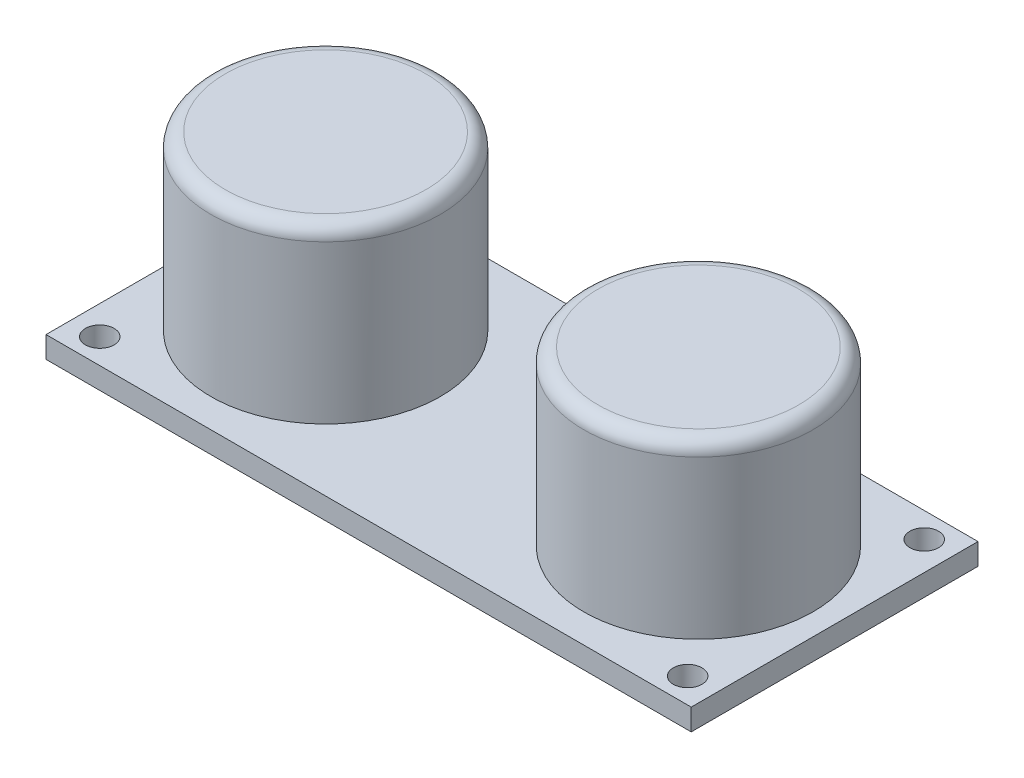
ISO-10303-21;
HEADER;
FILE_DESCRIPTION(('STEP AP214'),'2;1');
FILE_NAME('part.step','',(''),(''),'','','');
FILE_SCHEMA(('AUTOMOTIVE_DESIGN { 1 0 10303 214 1 1 1 1 }'));
ENDSEC;
DATA;
#1=APPLICATION_CONTEXT('core data for automotive mechanical design processes');
#2=APPLICATION_PROTOCOL_DEFINITION('international standard','automotive_design',2000,#1);
#3=PRODUCT_CONTEXT('',#1,'mechanical');
#4=PRODUCT('Part','Part','',(#3));
#5=PRODUCT_RELATED_PRODUCT_CATEGORY('part','',(#4));
#6=PRODUCT_DEFINITION_FORMATION('','',#4);
#7=PRODUCT_DEFINITION_CONTEXT('part definition',#1,'design');
#8=PRODUCT_DEFINITION('design','',#6,#7);
#9=PRODUCT_DEFINITION_SHAPE('','',#8);
#10=(LENGTH_UNIT() NAMED_UNIT(*) SI_UNIT(.MILLI.,.METRE.));
#11=(NAMED_UNIT(*) PLANE_ANGLE_UNIT() SI_UNIT($,.RADIAN.));
#12=(NAMED_UNIT(*) SI_UNIT($,.STERADIAN.) SOLID_ANGLE_UNIT());
#13=UNCERTAINTY_MEASURE_WITH_UNIT(LENGTH_MEASURE(1.E-05),#10,'distance_accuracy_value','');
#14=(GEOMETRIC_REPRESENTATION_CONTEXT(3) GLOBAL_UNCERTAINTY_ASSIGNED_CONTEXT((#13)) GLOBAL_UNIT_ASSIGNED_CONTEXT((#10,
#11,#12)) REPRESENTATION_CONTEXT('',''));
#15=CARTESIAN_POINT('',(0.,0.,0.));
#16=DIRECTION('',(0.,0.,1.));
#17=DIRECTION('',(1.,0.,0.));
#18=AXIS2_PLACEMENT_3D('',#15,#16,#17);
#19=CARTESIAN_POINT('',(0.,1.5,0.));
#20=DIRECTION('',(0.,-1.,0.));
#21=DIRECTION('',(0.,0.,-1.));
#22=AXIS2_PLACEMENT_3D('',#19,#20,#21);
#23=PLANE('',#22);
#24=CARTESIAN_POINT('',(35.5,1.5,-9.99999999999998));
#25=DIRECTION('',(0.,-1.,0.));
#26=DIRECTION('',(0.,0.,-1.));
#27=AXIS2_PLACEMENT_3D('',#24,#25,#26);
#28=CIRCLE('',#27,8.);
#29=CARTESIAN_POINT('',(35.5,1.5,-18.));
#30=VERTEX_POINT('',#29);
#31=EDGE_CURVE('E116',#30,#30,#28,.F.);
#32=ORIENTED_EDGE('',*,*,#31,.F.);
#33=EDGE_LOOP('',(#32));
#34=FACE_BOUND('',#33,.T.);
#35=CARTESIAN_POINT('',(9.5,1.5,-10.));
#36=DIRECTION('',(0.,-1.,0.));
#37=DIRECTION('',(0.,0.,-1.));
#38=AXIS2_PLACEMENT_3D('',#35,#36,#37);
#39=CIRCLE('',#38,8.);
#40=CARTESIAN_POINT('',(9.5,1.5,-18.));
#41=VERTEX_POINT('',#40);
#42=EDGE_CURVE('E113',#41,#41,#39,.F.);
#43=ORIENTED_EDGE('',*,*,#42,.F.);
#44=EDGE_LOOP('',(#43));
#45=FACE_BOUND('',#44,.T.);
#46=DIRECTION('',(0.,0.,1.));
#47=VECTOR('',#46,1.);
#48=CARTESIAN_POINT('',(0.,1.5,0.));
#49=LINE('',#48,#47);
#50=CARTESIAN_POINT('',(0.,1.5,-20.));
#51=VERTEX_POINT('',#50);
#52=CARTESIAN_POINT('',(0.,1.5,0.));
#53=VERTEX_POINT('',#52);
#54=EDGE_CURVE('E88',#51,#53,#49,.T.);
#55=ORIENTED_EDGE('',*,*,#54,.T.);
#56=DIRECTION('',(1.,0.,0.));
#57=VECTOR('',#56,1.);
#58=CARTESIAN_POINT('',(0.,1.5,0.));
#59=LINE('',#58,#57);
#60=CARTESIAN_POINT('',(45.,1.5,0.));
#61=VERTEX_POINT('',#60);
#62=EDGE_CURVE('E83',#53,#61,#59,.T.);
#63=ORIENTED_EDGE('',*,*,#62,.T.);
#64=DIRECTION('',(0.,0.,-1.));
#65=VECTOR('',#64,1.);
#66=CARTESIAN_POINT('',(45.,1.5,0.));
#67=LINE('',#66,#65);
#68=CARTESIAN_POINT('',(45.,1.5,-20.));
#69=VERTEX_POINT('',#68);
#70=EDGE_CURVE('E86',#61,#69,#67,.T.);
#71=ORIENTED_EDGE('',*,*,#70,.T.);
#72=DIRECTION('',(-1.,0.,0.));
#73=VECTOR('',#72,1.);
#74=CARTESIAN_POINT('',(0.,1.5,-20.));
#75=LINE('',#74,#73);
#76=EDGE_CURVE('E52',#69,#51,#75,.T.);
#77=ORIENTED_EDGE('',*,*,#76,.T.);
#78=EDGE_LOOP('',(#55,#63,#71,#77));
#79=FACE_BOUND('',#78,.T.);
#80=CARTESIAN_POINT('',(2.,1.5,-18.25));
#81=DIRECTION('',(0.,1.,0.));
#82=DIRECTION('',(0.,0.,1.));
#83=AXIS2_PLACEMENT_3D('',#80,#81,#82);
#84=CIRCLE('',#83,1.);
#85=CARTESIAN_POINT('',(2.,1.5,-17.25));
#86=VERTEX_POINT('',#85);
#87=EDGE_CURVE('E106',#86,#86,#84,.T.);
#88=ORIENTED_EDGE('',*,*,#87,.F.);
#89=EDGE_LOOP('',(#88));
#90=FACE_BOUND('',#89,.T.);
#91=CARTESIAN_POINT('',(2.,1.5,-1.75));
#92=DIRECTION('',(0.,1.,0.));
#93=DIRECTION('',(0.,0.,1.));
#94=AXIS2_PLACEMENT_3D('',#91,#92,#93);
#95=CIRCLE('',#94,1.);
#96=CARTESIAN_POINT('',(2.,1.5,-0.749999999999998));
#97=VERTEX_POINT('',#96);
#98=EDGE_CURVE('E186',#97,#97,#95,.T.);
#99=ORIENTED_EDGE('',*,*,#98,.F.);
#100=EDGE_LOOP('',(#99));
#101=FACE_BOUND('',#100,.T.);
#102=CARTESIAN_POINT('',(43.,1.5,-1.75));
#103=DIRECTION('',(0.,1.,0.));
#104=DIRECTION('',(0.,0.,-1.));
#105=AXIS2_PLACEMENT_3D('',#102,#103,#104);
#106=CIRCLE('',#105,1.00000000000001);
#107=CARTESIAN_POINT('',(43.,1.5,-2.75000000000001));
#108=VERTEX_POINT('',#107);
#109=EDGE_CURVE('E181',#108,#108,#106,.T.);
#110=ORIENTED_EDGE('',*,*,#109,.F.);
#111=EDGE_LOOP('',(#110));
#112=FACE_BOUND('',#111,.T.);
#113=CARTESIAN_POINT('',(43.,1.5,-18.25));
#114=DIRECTION('',(0.,1.,0.));
#115=DIRECTION('',(0.,0.,-1.));
#116=AXIS2_PLACEMENT_3D('',#113,#114,#115);
#117=CIRCLE('',#116,1.00000000000001);
#118=CARTESIAN_POINT('',(43.,1.5,-19.25));
#119=VERTEX_POINT('',#118);
#120=EDGE_CURVE('E175',#119,#119,#117,.T.);
#121=ORIENTED_EDGE('',*,*,#120,.F.);
#122=EDGE_LOOP('',(#121));
#123=FACE_BOUND('',#122,.T.);
#124=ADVANCED_FACE('F35',(#34,#45,#79,#90,#101,#112,#123),#23,.F.);
#125=CARTESIAN_POINT('',(0.,0.,0.));
#126=DIRECTION('',(0.,-1.,0.));
#127=DIRECTION('',(0.,0.,-1.));
#128=AXIS2_PLACEMENT_3D('',#125,#126,#127);
#129=PLANE('',#128);
#130=CARTESIAN_POINT('',(43.,0.,-1.75));
#131=DIRECTION('',(0.,1.,0.));
#132=DIRECTION('',(0.,0.,-1.));
#133=AXIS2_PLACEMENT_3D('',#130,#131,#132);
#134=CIRCLE('',#133,1.00000000000001);
#135=CARTESIAN_POINT('',(43.,0.,-2.75000000000001));
#136=VERTEX_POINT('',#135);
#137=EDGE_CURVE('E178',#136,#136,#134,.T.);
#138=ORIENTED_EDGE('',*,*,#137,.T.);
#139=EDGE_LOOP('',(#138));
#140=FACE_BOUND('',#139,.T.);
#141=CARTESIAN_POINT('',(2.,0.,-18.25));
#142=DIRECTION('',(0.,1.,0.));
#143=DIRECTION('',(0.,0.,1.));
#144=AXIS2_PLACEMENT_3D('',#141,#142,#143);
#145=CIRCLE('',#144,1.);
#146=CARTESIAN_POINT('',(2.,0.,-17.25));
#147=VERTEX_POINT('',#146);
#148=EDGE_CURVE('E189',#147,#147,#145,.T.);
#149=ORIENTED_EDGE('',*,*,#148,.T.);
#150=EDGE_LOOP('',(#149));
#151=FACE_BOUND('',#150,.T.);
#152=DIRECTION('',(0.,0.,1.));
#153=VECTOR('',#152,1.);
#154=CARTESIAN_POINT('',(0.,0.,0.));
#155=LINE('',#154,#153);
#156=CARTESIAN_POINT('',(0.,0.,-20.));
#157=VERTEX_POINT('',#156);
#158=CARTESIAN_POINT('',(0.,0.,0.));
#159=VERTEX_POINT('',#158);
#160=EDGE_CURVE('E103',#157,#159,#155,.T.);
#161=ORIENTED_EDGE('',*,*,#160,.F.);
#162=DIRECTION('',(-1.,0.,0.));
#163=VECTOR('',#162,1.);
#164=CARTESIAN_POINT('',(0.,0.,-20.));
#165=LINE('',#164,#163);
#166=CARTESIAN_POINT('',(45.,0.,-20.));
#167=VERTEX_POINT('',#166);
#168=EDGE_CURVE('E75',#167,#157,#165,.T.);
#169=ORIENTED_EDGE('',*,*,#168,.F.);
#170=DIRECTION('',(0.,0.,-1.));
#171=VECTOR('',#170,1.);
#172=CARTESIAN_POINT('',(45.,0.,0.));
#173=LINE('',#172,#171);
#174=CARTESIAN_POINT('',(45.,0.,0.));
#175=VERTEX_POINT('',#174);
#176=EDGE_CURVE('E69',#175,#167,#173,.T.);
#177=ORIENTED_EDGE('',*,*,#176,.F.);
#178=DIRECTION('',(1.,0.,0.));
#179=VECTOR('',#178,1.);
#180=CARTESIAN_POINT('',(0.,0.,0.));
#181=LINE('',#180,#179);
#182=EDGE_CURVE('E93',#159,#175,#181,.T.);
#183=ORIENTED_EDGE('',*,*,#182,.F.);
#184=EDGE_LOOP('',(#161,#169,#177,#183));
#185=FACE_BOUND('',#184,.T.);
#186=CARTESIAN_POINT('',(2.,0.,-1.75));
#187=DIRECTION('',(0.,1.,0.));
#188=DIRECTION('',(0.,0.,1.));
#189=AXIS2_PLACEMENT_3D('',#186,#187,#188);
#190=CIRCLE('',#189,1.);
#191=CARTESIAN_POINT('',(2.,0.,-0.749999999999998));
#192=VERTEX_POINT('',#191);
#193=EDGE_CURVE('E170',#192,#192,#190,.T.);
#194=ORIENTED_EDGE('',*,*,#193,.T.);
#195=EDGE_LOOP('',(#194));
#196=FACE_BOUND('',#195,.T.);
#197=CARTESIAN_POINT('',(43.,0.,-18.25));
#198=DIRECTION('',(0.,1.,0.));
#199=DIRECTION('',(0.,0.,-1.));
#200=AXIS2_PLACEMENT_3D('',#197,#198,#199);
#201=CIRCLE('',#200,1.00000000000001);
#202=CARTESIAN_POINT('',(43.,0.,-19.25));
#203=VERTEX_POINT('',#202);
#204=EDGE_CURVE('E173',#203,#203,#201,.T.);
#205=ORIENTED_EDGE('',*,*,#204,.T.);
#206=EDGE_LOOP('',(#205));
#207=FACE_BOUND('',#206,.T.);
#208=ADVANCED_FACE('F138',(#140,#151,#185,#196,#207),#129,.T.);
#209=CARTESIAN_POINT('',(0.,1.5,0.));
#210=DIRECTION('',(1.,0.,0.));
#211=DIRECTION('',(0.,0.,-1.));
#212=AXIS2_PLACEMENT_3D('',#209,#210,#211);
#213=PLANE('',#212);
#214=ORIENTED_EDGE('',*,*,#160,.T.);
#215=DIRECTION('',(0.,-1.,0.));
#216=VECTOR('',#215,1.);
#217=CARTESIAN_POINT('',(0.,1.5,0.));
#218=LINE('',#217,#216);
#219=EDGE_CURVE('E94',#53,#159,#218,.T.);
#220=ORIENTED_EDGE('',*,*,#219,.F.);
#221=ORIENTED_EDGE('',*,*,#54,.F.);
#222=DIRECTION('',(0.,-1.,0.));
#223=VECTOR('',#222,1.);
#224=CARTESIAN_POINT('',(0.,1.5,-20.));
#225=LINE('',#224,#223);
#226=EDGE_CURVE('E99',#51,#157,#225,.T.);
#227=ORIENTED_EDGE('',*,*,#226,.T.);
#228=EDGE_LOOP('',(#214,#220,#221,#227));
#229=FACE_BOUND('',#228,.T.);
#230=ADVANCED_FACE('F144',(#229),#213,.F.);
#231=CARTESIAN_POINT('',(0.,1.5,0.));
#232=DIRECTION('',(0.,0.,-1.));
#233=DIRECTION('',(-1.,0.,0.));
#234=AXIS2_PLACEMENT_3D('',#231,#232,#233);
#235=PLANE('',#234);
#236=ORIENTED_EDGE('',*,*,#182,.T.);
#237=DIRECTION('',(0.,-1.,0.));
#238=VECTOR('',#237,1.);
#239=CARTESIAN_POINT('',(45.,1.5,0.));
#240=LINE('',#239,#238);
#241=EDGE_CURVE('E91',#61,#175,#240,.T.);
#242=ORIENTED_EDGE('',*,*,#241,.F.);
#243=ORIENTED_EDGE('',*,*,#62,.F.);
#244=ORIENTED_EDGE('',*,*,#219,.T.);
#245=EDGE_LOOP('',(#236,#242,#243,#244));
#246=FACE_BOUND('',#245,.T.);
#247=ADVANCED_FACE('F92',(#246),#235,.F.);
#248=CARTESIAN_POINT('',(45.,1.5,0.));
#249=DIRECTION('',(-1.,0.,0.));
#250=DIRECTION('',(0.,0.,1.));
#251=AXIS2_PLACEMENT_3D('',#248,#249,#250);
#252=PLANE('',#251);
#253=ORIENTED_EDGE('',*,*,#176,.T.);
#254=DIRECTION('',(0.,-1.,0.));
#255=VECTOR('',#254,1.);
#256=CARTESIAN_POINT('',(45.,1.5,-20.));
#257=LINE('',#256,#255);
#258=EDGE_CURVE('E95',#69,#167,#257,.T.);
#259=ORIENTED_EDGE('',*,*,#258,.F.);
#260=ORIENTED_EDGE('',*,*,#70,.F.);
#261=ORIENTED_EDGE('',*,*,#241,.T.);
#262=EDGE_LOOP('',(#253,#259,#260,#261));
#263=FACE_BOUND('',#262,.T.);
#264=ADVANCED_FACE('F97',(#263),#252,.F.);
#265=CARTESIAN_POINT('',(0.,1.5,-20.));
#266=DIRECTION('',(0.,0.,1.));
#267=DIRECTION('',(1.,0.,0.));
#268=AXIS2_PLACEMENT_3D('',#265,#266,#267);
#269=PLANE('',#268);
#270=ORIENTED_EDGE('',*,*,#168,.T.);
#271=ORIENTED_EDGE('',*,*,#226,.F.);
#272=ORIENTED_EDGE('',*,*,#76,.F.);
#273=ORIENTED_EDGE('',*,*,#258,.T.);
#274=EDGE_LOOP('',(#270,#271,#272,#273));
#275=FACE_BOUND('',#274,.T.);
#276=ADVANCED_FACE('F153',(#275),#269,.F.);
#277=CARTESIAN_POINT('',(2.,1.5,-18.25));
#278=DIRECTION('',(0.,-1.,0.));
#279=DIRECTION('',(0.,0.,-1.));
#280=AXIS2_PLACEMENT_3D('',#277,#278,#279);
#281=CYLINDRICAL_SURFACE('',#280,1.);
#282=ORIENTED_EDGE('',*,*,#87,.T.);
#283=EDGE_LOOP('',(#282));
#284=FACE_BOUND('',#283,.T.);
#285=ORIENTED_EDGE('',*,*,#148,.F.);
#286=EDGE_LOOP('',(#285));
#287=FACE_BOUND('',#286,.T.);
#288=ADVANCED_FACE('F150',(#284,#287),#281,.F.);
#289=CARTESIAN_POINT('',(2.,1.5,-1.75));
#290=DIRECTION('',(0.,-1.,0.));
#291=DIRECTION('',(0.,0.,-1.));
#292=AXIS2_PLACEMENT_3D('',#289,#290,#291);
#293=CYLINDRICAL_SURFACE('',#292,1.);
#294=ORIENTED_EDGE('',*,*,#98,.T.);
#295=EDGE_LOOP('',(#294));
#296=FACE_BOUND('',#295,.T.);
#297=ORIENTED_EDGE('',*,*,#193,.F.);
#298=EDGE_LOOP('',(#297));
#299=FACE_BOUND('',#298,.T.);
#300=ADVANCED_FACE('F198',(#296,#299),#293,.F.);
#301=CARTESIAN_POINT('',(43.,1.5,-1.75));
#302=DIRECTION('',(0.,-1.,0.));
#303=DIRECTION('',(0.,0.,-1.));
#304=AXIS2_PLACEMENT_3D('',#301,#302,#303);
#305=CYLINDRICAL_SURFACE('',#304,1.00000000000001);
#306=ORIENTED_EDGE('',*,*,#109,.T.);
#307=EDGE_LOOP('',(#306));
#308=FACE_BOUND('',#307,.T.);
#309=ORIENTED_EDGE('',*,*,#137,.F.);
#310=EDGE_LOOP('',(#309));
#311=FACE_BOUND('',#310,.T.);
#312=ADVANCED_FACE('F203',(#308,#311),#305,.F.);
#313=CARTESIAN_POINT('',(43.,1.5,-18.25));
#314=DIRECTION('',(0.,-1.,0.));
#315=DIRECTION('',(0.,0.,-1.));
#316=AXIS2_PLACEMENT_3D('',#313,#314,#315);
#317=CYLINDRICAL_SURFACE('',#316,1.00000000000001);
#318=ORIENTED_EDGE('',*,*,#120,.T.);
#319=EDGE_LOOP('',(#318));
#320=FACE_BOUND('',#319,.T.);
#321=ORIENTED_EDGE('',*,*,#204,.F.);
#322=EDGE_LOOP('',(#321));
#323=FACE_BOUND('',#322,.T.);
#324=ADVANCED_FACE('F213',(#320,#323),#317,.F.);
#325=CARTESIAN_POINT('',(9.5,13.5,-10.));
#326=DIRECTION('',(0.,-1.,0.));
#327=DIRECTION('',(0.,0.,-1.));
#328=AXIS2_PLACEMENT_3D('',#325,#326,#327);
#329=CYLINDRICAL_SURFACE('',#328,8.);
#330=CARTESIAN_POINT('',(9.5,12.5,-10.));
#331=DIRECTION('',(0.,1.,0.));
#332=DIRECTION('',(0.,0.,1.));
#333=AXIS2_PLACEMENT_3D('',#330,#331,#332);
#334=CIRCLE('',#333,8.);
#335=CARTESIAN_POINT('',(9.5,12.5,-2.));
#336=VERTEX_POINT('',#335);
#337=EDGE_CURVE('E122',#336,#336,#334,.F.);
#338=ORIENTED_EDGE('',*,*,#337,.T.);
#339=EDGE_LOOP('',(#338));
#340=FACE_BOUND('',#339,.T.);
#341=ORIENTED_EDGE('',*,*,#42,.T.);
#342=EDGE_LOOP('',(#341));
#343=FACE_BOUND('',#342,.T.);
#344=ADVANCED_FACE('F215',(#340,#343),#329,.T.);
#345=CARTESIAN_POINT('',(9.5,13.5,-10.));
#346=DIRECTION('',(0.,1.,0.));
#347=DIRECTION('',(0.,0.,1.));
#348=AXIS2_PLACEMENT_3D('',#345,#346,#347);
#349=PLANE('',#348);
#350=CARTESIAN_POINT('',(9.5,13.5,-10.));
#351=DIRECTION('',(0.,1.,0.));
#352=DIRECTION('',(0.,0.,1.));
#353=AXIS2_PLACEMENT_3D('',#350,#351,#352);
#354=CIRCLE('',#353,7.);
#355=CARTESIAN_POINT('',(9.5,13.5,-3.));
#356=VERTEX_POINT('',#355);
#357=EDGE_CURVE('E119',#356,#356,#354,.T.);
#358=ORIENTED_EDGE('',*,*,#357,.T.);
#359=EDGE_LOOP('',(#358));
#360=FACE_BOUND('',#359,.T.);
#361=ADVANCED_FACE('F222',(#360),#349,.T.);
#362=CARTESIAN_POINT('',(35.5,13.5,-9.99999999999998));
#363=DIRECTION('',(0.,-1.,0.));
#364=DIRECTION('',(0.,0.,-1.));
#365=AXIS2_PLACEMENT_3D('',#362,#363,#364);
#366=CYLINDRICAL_SURFACE('',#365,8.);
#367=CARTESIAN_POINT('',(35.5,12.5,-9.99999999999998));
#368=DIRECTION('',(0.,-1.,0.));
#369=DIRECTION('',(0.,0.,-1.));
#370=AXIS2_PLACEMENT_3D('',#367,#368,#369);
#371=CIRCLE('',#370,8.);
#372=CARTESIAN_POINT('',(35.5,12.5,-18.));
#373=VERTEX_POINT('',#372);
#374=EDGE_CURVE('E11',#373,#373,#371,.T.);
#375=ORIENTED_EDGE('',*,*,#374,.T.);
#376=EDGE_LOOP('',(#375));
#377=FACE_BOUND('',#376,.T.);
#378=ORIENTED_EDGE('',*,*,#31,.T.);
#379=EDGE_LOOP('',(#378));
#380=FACE_BOUND('',#379,.T.);
#381=ADVANCED_FACE('F230',(#377,#380),#366,.T.);
#382=CARTESIAN_POINT('',(35.5,13.5,-9.99999999999998));
#383=DIRECTION('',(0.,-1.,0.));
#384=DIRECTION('',(0.,0.,-1.));
#385=AXIS2_PLACEMENT_3D('',#382,#383,#384);
#386=PLANE('',#385);
#387=CARTESIAN_POINT('',(35.5,13.5,-9.99999999999998));
#388=DIRECTION('',(0.,-1.,0.));
#389=DIRECTION('',(0.,0.,-1.));
#390=AXIS2_PLACEMENT_3D('',#387,#388,#389);
#391=CIRCLE('',#390,7.);
#392=CARTESIAN_POINT('',(35.5,13.5,-17.));
#393=VERTEX_POINT('',#392);
#394=EDGE_CURVE('E44',#393,#393,#391,.F.);
#395=ORIENTED_EDGE('',*,*,#394,.T.);
#396=EDGE_LOOP('',(#395));
#397=FACE_BOUND('',#396,.T.);
#398=ADVANCED_FACE('F127',(#397),#386,.F.);
#399=CARTESIAN_POINT('',(9.5,12.5,-10.));
#400=DIRECTION('',(0.,1.,0.));
#401=DIRECTION('',(0.,0.,1.));
#402=AXIS2_PLACEMENT_3D('',#399,#400,#401);
#403=TOROIDAL_SURFACE('',#402,7.,1.);
#404=ORIENTED_EDGE('',*,*,#337,.F.);
#405=EDGE_LOOP('',(#404));
#406=FACE_BOUND('',#405,.T.);
#407=ORIENTED_EDGE('',*,*,#357,.F.);
#408=EDGE_LOOP('',(#407));
#409=FACE_BOUND('',#408,.T.);
#410=ADVANCED_FACE('F130',(#406,#409),#403,.T.);
#411=CARTESIAN_POINT('',(35.5,12.5,-9.99999999999998));
#412=DIRECTION('',(0.,-1.,0.));
#413=DIRECTION('',(0.,0.,-1.));
#414=AXIS2_PLACEMENT_3D('',#411,#412,#413);
#415=TOROIDAL_SURFACE('',#414,7.,1.);
#416=ORIENTED_EDGE('',*,*,#374,.F.);
#417=EDGE_LOOP('',(#416));
#418=FACE_BOUND('',#417,.T.);
#419=ORIENTED_EDGE('',*,*,#394,.F.);
#420=EDGE_LOOP('',(#419));
#421=FACE_BOUND('',#420,.T.);
#422=ADVANCED_FACE('F37',(#418,#421),#415,.T.);
#423=CLOSED_SHELL('',(#124,#208,#230,#247,#264,#276,#288,#300,#312,#324,#344,#361,#381,#398,
#410,#422));
#424=MANIFOLD_SOLID_BREP('B2',#423);
#425=ADVANCED_BREP_SHAPE_REPRESENTATION('',(#18,#424),#14);
#426=SHAPE_DEFINITION_REPRESENTATION(#9,#425);
ENDSEC;
END-ISO-10303-21;
